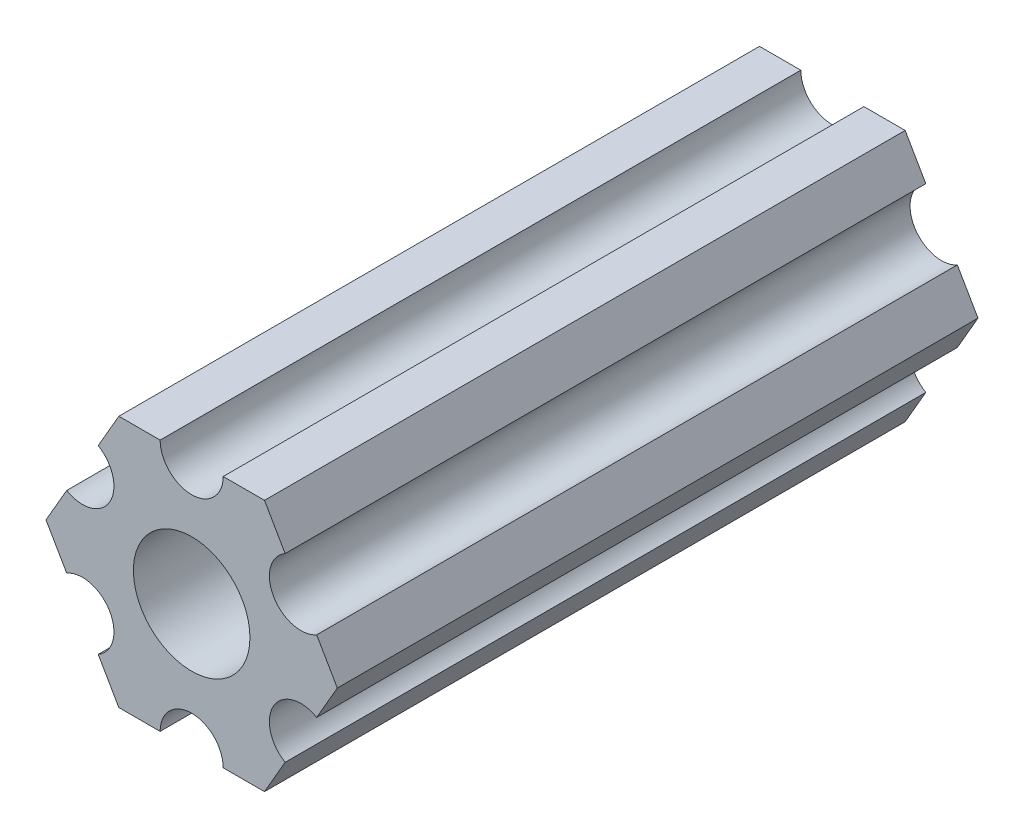
ISO-10303-21;
HEADER;
FILE_DESCRIPTION(('STEP AP214'),'2;1');
FILE_NAME('part.step','',(''),(''),'','','');
FILE_SCHEMA(('AUTOMOTIVE_DESIGN { 1 0 10303 214 1 1 1 1 }'));
ENDSEC;
DATA;
#1=APPLICATION_CONTEXT('core data for automotive mechanical design processes');
#2=APPLICATION_PROTOCOL_DEFINITION('international standard','automotive_design',2000,#1);
#3=PRODUCT_CONTEXT('',#1,'mechanical');
#4=PRODUCT('Part','Part','',(#3));
#5=PRODUCT_RELATED_PRODUCT_CATEGORY('part','',(#4));
#6=PRODUCT_DEFINITION_FORMATION('','',#4);
#7=PRODUCT_DEFINITION_CONTEXT('part definition',#1,'design');
#8=PRODUCT_DEFINITION('design','',#6,#7);
#9=PRODUCT_DEFINITION_SHAPE('','',#8);
#10=(LENGTH_UNIT() NAMED_UNIT(*) SI_UNIT(.MILLI.,.METRE.));
#11=(NAMED_UNIT(*) PLANE_ANGLE_UNIT() SI_UNIT($,.RADIAN.));
#12=(NAMED_UNIT(*) SI_UNIT($,.STERADIAN.) SOLID_ANGLE_UNIT());
#13=UNCERTAINTY_MEASURE_WITH_UNIT(LENGTH_MEASURE(1.E-05),#10,'distance_accuracy_value','');
#14=(GEOMETRIC_REPRESENTATION_CONTEXT(3) GLOBAL_UNCERTAINTY_ASSIGNED_CONTEXT((#13)) GLOBAL_UNIT_ASSIGNED_CONTEXT((#10,
#11,#12)) REPRESENTATION_CONTEXT('',''));
#15=CARTESIAN_POINT('',(0.,0.,0.));
#16=DIRECTION('',(0.,0.,1.));
#17=DIRECTION('',(1.,0.,0.));
#18=AXIS2_PLACEMENT_3D('',#15,#16,#17);
#19=CARTESIAN_POINT('',(5.49926150638083,-3.17499966684068,32.249999));
#20=DIRECTION('',(0.,0.,-1.));
#21=DIRECTION('',(-1.,0.,0.));
#22=AXIS2_PLACEMENT_3D('',#19,#20,#21);
#23=CYLINDRICAL_SURFACE('',#22,1.58750000000001);
#24=CARTESIAN_POINT('',(5.49926150638083,-3.17499966684068,0.));
#25=DIRECTION('',(0.,0.,1.));
#26=DIRECTION('',(1.,0.,0.));
#27=AXIS2_PLACEMENT_3D('',#24,#25,#26);
#28=CIRCLE('',#27,1.58750000000001);
#29=CARTESIAN_POINT('',(6.29301142309098,-1.80018429024546,0.));
#30=VERTEX_POINT('',#29);
#31=CARTESIAN_POINT('',(4.70551158967068,-4.54981504343589,0.));
#32=VERTEX_POINT('',#31);
#33=EDGE_CURVE('E190',#30,#32,#28,.T.);
#34=ORIENTED_EDGE('',*,*,#33,.F.);
#35=DIRECTION('',(0.,0.,-1.));
#36=VECTOR('',#35,1.);
#37=CARTESIAN_POINT('',(6.29301142309098,-1.80018429024546,32.249999));
#38=LINE('',#37,#36);
#39=CARTESIAN_POINT('',(6.29301142309098,-1.80018429024546,32.249999));
#40=VERTEX_POINT('',#39);
#41=EDGE_CURVE('E11',#40,#30,#38,.T.);
#42=ORIENTED_EDGE('',*,*,#41,.F.);
#43=CARTESIAN_POINT('',(5.49926150638083,-3.17499966684068,32.249999));
#44=DIRECTION('',(0.,0.,1.));
#45=DIRECTION('',(1.,0.,0.));
#46=AXIS2_PLACEMENT_3D('',#43,#44,#45);
#47=CIRCLE('',#46,1.58750000000001);
#48=CARTESIAN_POINT('',(4.70551158967068,-4.54981504343589,32.249999));
#49=VERTEX_POINT('',#48);
#50=EDGE_CURVE('E241',#40,#49,#47,.T.);
#51=ORIENTED_EDGE('',*,*,#50,.T.);
#52=DIRECTION('',(0.,0.,-1.));
#53=VECTOR('',#52,1.);
#54=CARTESIAN_POINT('',(4.70551158967068,-4.54981504343589,32.249999));
#55=LINE('',#54,#53);
#56=EDGE_CURVE('E36',#49,#32,#55,.T.);
#57=ORIENTED_EDGE('',*,*,#56,.T.);
#58=EDGE_LOOP('',(#34,#42,#51,#57));
#59=FACE_BOUND('',#58,.T.);
#60=ADVANCED_FACE('F33',(#59),#23,.F.);
#61=CARTESIAN_POINT('',(7.33234841870826,4.44212518856872E-07,32.249999));
#62=DIRECTION('',(0.866025434075723,-0.499999947533953,0.));
#63=DIRECTION('',(0.499999947533953,0.866025434075723,0.));
#64=AXIS2_PLACEMENT_3D('',#61,#62,#63);
#65=PLANE('',#64);
#66=DIRECTION('',(-0.499999947533953,-0.866025434075723,0.));
#67=VECTOR('',#66,1.);
#68=CARTESIAN_POINT('',(7.33234841870826,4.44212518856872E-07,0.));
#69=LINE('',#68,#67);
#70=CARTESIAN_POINT('',(7.33234841870826,4.44212518856872E-07,0.));
#71=VERTEX_POINT('',#70);
#72=EDGE_CURVE('E239',#71,#30,#69,.T.);
#73=ORIENTED_EDGE('',*,*,#72,.F.);
#74=DIRECTION('',(0.,0.,-1.));
#75=VECTOR('',#74,1.);
#76=CARTESIAN_POINT('',(7.33234841870826,4.44212518856872E-07,32.249999));
#77=LINE('',#76,#75);
#78=CARTESIAN_POINT('',(7.33234841870826,4.44212518856872E-07,32.249999));
#79=VERTEX_POINT('',#78);
#80=EDGE_CURVE('E42',#79,#71,#77,.T.);
#81=ORIENTED_EDGE('',*,*,#80,.F.);
#82=DIRECTION('',(-0.499999947533953,-0.866025434075723,0.));
#83=VECTOR('',#82,1.);
#84=CARTESIAN_POINT('',(7.33234841870826,4.44212518856872E-07,32.249999));
#85=LINE('',#84,#83);
#86=EDGE_CURVE('E180',#79,#40,#85,.T.);
#87=ORIENTED_EDGE('',*,*,#86,.T.);
#88=ORIENTED_EDGE('',*,*,#41,.T.);
#89=EDGE_LOOP('',(#73,#81,#87,#88));
#90=FACE_BOUND('',#89,.T.);
#91=ADVANCED_FACE('F273',(#90),#65,.T.);
#92=CARTESIAN_POINT('',(6.29301120497139,1.80018505273895,32.249999));
#93=DIRECTION('',(0.866025373493145,0.500000052466056,0.));
#94=DIRECTION('',(-0.500000052466056,0.866025373493145,0.));
#95=AXIS2_PLACEMENT_3D('',#92,#93,#94);
#96=PLANE('',#95);
#97=DIRECTION('',(0.500000052466056,-0.866025373493145,0.));
#98=VECTOR('',#97,1.);
#99=CARTESIAN_POINT('',(6.29301120497139,1.80018505273895,0.));
#100=LINE('',#99,#98);
#101=CARTESIAN_POINT('',(6.29301120497139,1.80018505273895,0.));
#102=VERTEX_POINT('',#101);
#103=EDGE_CURVE('E167',#102,#71,#100,.T.);
#104=ORIENTED_EDGE('',*,*,#103,.F.);
#105=DIRECTION('',(0.,0.,-1.));
#106=VECTOR('',#105,1.);
#107=CARTESIAN_POINT('',(6.29301120497139,1.80018505273895,32.249999));
#108=LINE('',#107,#106);
#109=CARTESIAN_POINT('',(6.29301120497139,1.80018505273895,32.249999));
#110=VERTEX_POINT('',#109);
#111=EDGE_CURVE('E162',#110,#102,#108,.T.);
#112=ORIENTED_EDGE('',*,*,#111,.F.);
#113=DIRECTION('',(0.500000052466056,-0.866025373493145,0.));
#114=VECTOR('',#113,1.);
#115=CARTESIAN_POINT('',(6.29301120497139,1.80018505273895,32.249999));
#116=LINE('',#115,#114);
#117=EDGE_CURVE('E165',#110,#79,#116,.T.);
#118=ORIENTED_EDGE('',*,*,#117,.T.);
#119=ORIENTED_EDGE('',*,*,#80,.T.);
#120=EDGE_LOOP('',(#104,#112,#118,#119));
#121=FACE_BOUND('',#120,.T.);
#122=ADVANCED_FACE('F164',(#121),#96,.T.);
#123=CARTESIAN_POINT('',(5.49926112168152,3.17500033315931,32.249999));
#124=DIRECTION('',(0.,0.,-1.));
#125=DIRECTION('',(-1.,0.,0.));
#126=AXIS2_PLACEMENT_3D('',#123,#124,#125);
#127=CYLINDRICAL_SURFACE('',#126,1.5875);
#128=CARTESIAN_POINT('',(5.49926112168152,3.17500033315931,0.));
#129=DIRECTION('',(0.,0.,1.));
#130=DIRECTION('',(1.,0.,0.));
#131=AXIS2_PLACEMENT_3D('',#128,#129,#130);
#132=CIRCLE('',#131,1.5875);
#133=CARTESIAN_POINT('',(4.70551103839166,4.54981561357968,0.));
#134=VERTEX_POINT('',#133);
#135=EDGE_CURVE('E236',#134,#102,#132,.T.);
#136=ORIENTED_EDGE('',*,*,#135,.F.);
#137=DIRECTION('',(0.,0.,-1.));
#138=VECTOR('',#137,1.);
#139=CARTESIAN_POINT('',(4.70551103839166,4.54981561357968,32.249999));
#140=LINE('',#139,#138);
#141=CARTESIAN_POINT('',(4.70551103839166,4.54981561357968,32.249999));
#142=VERTEX_POINT('',#141);
#143=EDGE_CURVE('E172',#142,#134,#140,.T.);
#144=ORIENTED_EDGE('',*,*,#143,.F.);
#145=CARTESIAN_POINT('',(5.49926112168152,3.17500033315931,32.249999));
#146=DIRECTION('',(0.,0.,1.));
#147=DIRECTION('',(1.,0.,0.));
#148=AXIS2_PLACEMENT_3D('',#145,#146,#147);
#149=CIRCLE('',#148,1.5875);
#150=EDGE_CURVE('E178',#142,#110,#149,.T.);
#151=ORIENTED_EDGE('',*,*,#150,.T.);
#152=ORIENTED_EDGE('',*,*,#111,.T.);
#153=EDGE_LOOP('',(#136,#144,#151,#152));
#154=FACE_BOUND('',#153,.T.);
#155=ADVANCED_FACE('F182',(#154),#127,.F.);
#156=CARTESIAN_POINT('',(3.66617382465472,6.35000022210622,32.249999));
#157=DIRECTION('',(0.866025373493145,0.500000052466056,0.));
#158=DIRECTION('',(-0.500000052466056,0.866025373493145,0.));
#159=AXIS2_PLACEMENT_3D('',#156,#157,#158);
#160=PLANE('',#159);
#161=DIRECTION('',(0.500000052466056,-0.866025373493145,0.));
#162=VECTOR('',#161,1.);
#163=CARTESIAN_POINT('',(3.66617382465472,6.35000022210622,0.));
#164=LINE('',#163,#162);
#165=CARTESIAN_POINT('',(3.66617382465472,6.35000022210622,0.));
#166=VERTEX_POINT('',#165);
#167=EDGE_CURVE('E233',#166,#134,#164,.T.);
#168=ORIENTED_EDGE('',*,*,#167,.F.);
#169=DIRECTION('',(0.,0.,-1.));
#170=VECTOR('',#169,1.);
#171=CARTESIAN_POINT('',(3.66617382465472,6.35000022210622,32.249999));
#172=LINE('',#171,#170);
#173=CARTESIAN_POINT('',(3.66617382465472,6.35000022210622,32.249999));
#174=VERTEX_POINT('',#173);
#175=EDGE_CURVE('E245',#174,#166,#172,.T.);
#176=ORIENTED_EDGE('',*,*,#175,.F.);
#177=DIRECTION('',(0.500000052466056,-0.866025373493145,0.));
#178=VECTOR('',#177,1.);
#179=CARTESIAN_POINT('',(3.66617382465472,6.35000022210622,32.249999));
#180=LINE('',#179,#178);
#181=EDGE_CURVE('E183',#174,#142,#180,.T.);
#182=ORIENTED_EDGE('',*,*,#181,.T.);
#183=ORIENTED_EDGE('',*,*,#143,.T.);
#184=EDGE_LOOP('',(#168,#176,#182,#183));
#185=FACE_BOUND('',#184,.T.);
#186=ADVANCED_FACE('F286',(#185),#160,.T.);
#187=CARTESIAN_POINT('',(1.58749961530066,6.35000022210623,32.249999));
#188=DIRECTION('',(0.,1.,0.));
#189=DIRECTION('',(-1.,0.,0.));
#190=AXIS2_PLACEMENT_3D('',#187,#188,#189);
#191=PLANE('',#190);
#192=DIRECTION('',(1.,0.,0.));
#193=VECTOR('',#192,1.);
#194=CARTESIAN_POINT('',(1.58749961530066,6.35000022210623,0.));
#195=LINE('',#194,#193);
#196=CARTESIAN_POINT('',(1.58749961530066,6.35000022210623,0.));
#197=VERTEX_POINT('',#196);
#198=EDGE_CURVE('E230',#197,#166,#195,.T.);
#199=ORIENTED_EDGE('',*,*,#198,.F.);
#200=DIRECTION('',(0.,0.,-1.));
#201=VECTOR('',#200,1.);
#202=CARTESIAN_POINT('',(1.58749961530066,6.35000022210623,32.249999));
#203=LINE('',#202,#201);
#204=CARTESIAN_POINT('',(1.58749961530066,6.35000022210623,32.249999));
#205=VERTEX_POINT('',#204);
#206=EDGE_CURVE('E247',#205,#197,#203,.T.);
#207=ORIENTED_EDGE('',*,*,#206,.F.);
#208=DIRECTION('',(1.,0.,0.));
#209=VECTOR('',#208,1.);
#210=CARTESIAN_POINT('',(1.58749961530066,6.35000022210623,32.249999));
#211=LINE('',#210,#209);
#212=EDGE_CURVE('E185',#205,#174,#211,.T.);
#213=ORIENTED_EDGE('',*,*,#212,.T.);
#214=ORIENTED_EDGE('',*,*,#175,.T.);
#215=EDGE_LOOP('',(#199,#207,#213,#214));
#216=FACE_BOUND('',#215,.T.);
#217=ADVANCED_FACE('F289',(#216),#191,.T.);
#218=CARTESIAN_POINT('',(-3.84699344941095E-07,6.35000022210623,32.249999));
#219=DIRECTION('',(0.,0.,-1.));
#220=DIRECTION('',(-1.,0.,0.));
#221=AXIS2_PLACEMENT_3D('',#218,#219,#220);
#222=CYLINDRICAL_SURFACE('',#221,1.5875);
#223=CARTESIAN_POINT('',(-3.84699344941095E-07,6.35000022210623,0.));
#224=DIRECTION('',(0.,0.,1.));
#225=DIRECTION('',(1.,0.,0.));
#226=AXIS2_PLACEMENT_3D('',#223,#224,#225);
#227=CIRCLE('',#226,1.5875);
#228=CARTESIAN_POINT('',(-1.58750038469935,6.35000022210623,0.));
#229=VERTEX_POINT('',#228);
#230=EDGE_CURVE('E227',#229,#197,#227,.T.);
#231=ORIENTED_EDGE('',*,*,#230,.F.);
#232=DIRECTION('',(0.,0.,-1.));
#233=VECTOR('',#232,1.);
#234=CARTESIAN_POINT('',(-1.58750038469935,6.35000022210623,32.249999));
#235=LINE('',#234,#233);
#236=CARTESIAN_POINT('',(-1.58750038469935,6.35000022210623,32.249999));
#237=VERTEX_POINT('',#236);
#238=EDGE_CURVE('E249',#237,#229,#235,.T.);
#239=ORIENTED_EDGE('',*,*,#238,.F.);
#240=CARTESIAN_POINT('',(-3.84699344941095E-07,6.35000022210623,32.249999));
#241=DIRECTION('',(0.,0.,1.));
#242=DIRECTION('',(1.,0.,0.));
#243=AXIS2_PLACEMENT_3D('',#240,#241,#242);
#244=CIRCLE('',#243,1.5875);
#245=EDGE_CURVE('E394',#237,#205,#244,.T.);
#246=ORIENTED_EDGE('',*,*,#245,.T.);
#247=ORIENTED_EDGE('',*,*,#206,.T.);
#248=EDGE_LOOP('',(#231,#239,#246,#247));
#249=FACE_BOUND('',#248,.T.);
#250=ADVANCED_FACE('F293',(#249),#222,.F.);
#251=CARTESIAN_POINT('',(-3.66617452134701,6.35000022210623,32.249999));
#252=DIRECTION('',(0.,1.,0.));
#253=DIRECTION('',(0.,0.,1.));
#254=AXIS2_PLACEMENT_3D('',#251,#252,#253);
#255=PLANE('',#254);
#256=DIRECTION('',(1.,0.,0.));
#257=VECTOR('',#256,1.);
#258=CARTESIAN_POINT('',(-3.66617452134701,6.35000022210623,0.));
#259=LINE('',#258,#257);
#260=CARTESIAN_POINT('',(-3.66617452134701,6.35000022210623,0.));
#261=VERTEX_POINT('',#260);
#262=EDGE_CURVE('E224',#261,#229,#259,.T.);
#263=ORIENTED_EDGE('',*,*,#262,.F.);
#264=DIRECTION('',(0.,0.,-1.));
#265=VECTOR('',#264,1.);
#266=CARTESIAN_POINT('',(-3.66617452134701,6.35000022210623,32.249999));
#267=LINE('',#266,#265);
#268=CARTESIAN_POINT('',(-3.66617452134701,6.35000022210623,32.249999));
#269=VERTEX_POINT('',#268);
#270=EDGE_CURVE('E251',#269,#261,#267,.T.);
#271=ORIENTED_EDGE('',*,*,#270,.F.);
#272=DIRECTION('',(1.,0.,0.));
#273=VECTOR('',#272,1.);
#274=CARTESIAN_POINT('',(-3.66617452134701,6.35000022210623,32.249999));
#275=LINE('',#274,#273);
#276=EDGE_CURVE('E391',#269,#237,#275,.T.);
#277=ORIENTED_EDGE('',*,*,#276,.T.);
#278=ORIENTED_EDGE('',*,*,#238,.T.);
#279=EDGE_LOOP('',(#263,#271,#277,#278));
#280=FACE_BOUND('',#279,.T.);
#281=ADVANCED_FACE('F297',(#280),#255,.T.);
#282=CARTESIAN_POINT('',(-4.70551145677116,4.54981548085265,32.249999));
#283=DIRECTION('',(-0.866025447431971,0.499999924400249,0.));
#284=DIRECTION('',(-0.499999924400249,-0.866025447431971,0.));
#285=AXIS2_PLACEMENT_3D('',#282,#283,#284);
#286=PLANE('',#285);
#287=DIRECTION('',(0.499999924400249,0.866025447431971,0.));
#288=VECTOR('',#287,1.);
#289=CARTESIAN_POINT('',(-4.70551145677116,4.54981548085265,0.));
#290=LINE('',#289,#288);
#291=CARTESIAN_POINT('',(-4.70551145677116,4.54981548085265,0.));
#292=VERTEX_POINT('',#291);
#293=EDGE_CURVE('E221',#292,#261,#290,.T.);
#294=ORIENTED_EDGE('',*,*,#293,.F.);
#295=DIRECTION('',(0.,0.,-1.));
#296=VECTOR('',#295,1.);
#297=CARTESIAN_POINT('',(-4.70551145677116,4.54981548085265,32.249999));
#298=LINE('',#297,#296);
#299=CARTESIAN_POINT('',(-4.70551145677116,4.54981548085265,32.249999));
#300=VERTEX_POINT('',#299);
#301=EDGE_CURVE('E253',#300,#292,#298,.T.);
#302=ORIENTED_EDGE('',*,*,#301,.F.);
#303=DIRECTION('',(0.499999924400249,0.866025447431971,0.));
#304=VECTOR('',#303,1.);
#305=CARTESIAN_POINT('',(-4.70551145677116,4.54981548085265,32.249999));
#306=LINE('',#305,#304);
#307=EDGE_CURVE('E388',#300,#269,#306,.T.);
#308=ORIENTED_EDGE('',*,*,#307,.T.);
#309=ORIENTED_EDGE('',*,*,#270,.T.);
#310=EDGE_LOOP('',(#294,#302,#308,#309));
#311=FACE_BOUND('',#310,.T.);
#312=ADVANCED_FACE('F301',(#311),#286,.T.);
#313=CARTESIAN_POINT('',(-5.49926133675655,3.17500008305439,32.249999));
#314=DIRECTION('',(0.,0.,-1.));
#315=DIRECTION('',(-1.,0.,0.));
#316=AXIS2_PLACEMENT_3D('',#313,#314,#315);
#317=CYLINDRICAL_SURFACE('',#316,1.5875);
#318=CARTESIAN_POINT('',(-5.49926133675655,3.17500008305439,0.));
#319=DIRECTION('',(0.,0.,1.));
#320=DIRECTION('',(1.,0.,0.));
#321=AXIS2_PLACEMENT_3D('',#318,#319,#320);
#322=CIRCLE('',#321,1.5875);
#323=CARTESIAN_POINT('',(-6.29301121674195,1.80018468525613,0.));
#324=VERTEX_POINT('',#323);
#325=EDGE_CURVE('E218',#324,#292,#322,.T.);
#326=ORIENTED_EDGE('',*,*,#325,.F.);
#327=DIRECTION('',(0.,0.,-1.));
#328=VECTOR('',#327,1.);
#329=CARTESIAN_POINT('',(-6.29301121674195,1.80018468525613,32.249999));
#330=LINE('',#329,#328);
#331=CARTESIAN_POINT('',(-6.29301121674195,1.80018468525613,32.249999));
#332=VERTEX_POINT('',#331);
#333=EDGE_CURVE('E255',#332,#324,#330,.T.);
#334=ORIENTED_EDGE('',*,*,#333,.F.);
#335=CARTESIAN_POINT('',(-5.49926133675655,3.17500008305439,32.249999));
#336=DIRECTION('',(0.,0.,1.));
#337=DIRECTION('',(1.,0.,0.));
#338=AXIS2_PLACEMENT_3D('',#335,#336,#337);
#339=CIRCLE('',#338,1.5875);
#340=EDGE_CURVE('E385',#332,#300,#339,.T.);
#341=ORIENTED_EDGE('',*,*,#340,.T.);
#342=ORIENTED_EDGE('',*,*,#301,.T.);
#343=EDGE_LOOP('',(#326,#334,#341,#342));
#344=FACE_BOUND('',#343,.T.);
#345=ADVANCED_FACE('F305',(#344),#317,.F.);
#346=CARTESIAN_POINT('',(-7.33234807945963,6.99338729030344E-08,32.249999));
#347=DIRECTION('',(-0.866025447431971,0.499999924400249,0.));
#348=DIRECTION('',(-0.499999924400249,-0.866025447431971,0.));
#349=AXIS2_PLACEMENT_3D('',#346,#347,#348);
#350=PLANE('',#349);
#351=DIRECTION('',(0.499999924400249,0.866025447431971,0.));
#352=VECTOR('',#351,1.);
#353=CARTESIAN_POINT('',(-7.33234807945963,6.99338729030344E-08,0.));
#354=LINE('',#353,#352);
#355=CARTESIAN_POINT('',(-7.33234807945963,6.99338729030344E-08,0.));
#356=VERTEX_POINT('',#355);
#357=EDGE_CURVE('E215',#356,#324,#354,.T.);
#358=ORIENTED_EDGE('',*,*,#357,.F.);
#359=DIRECTION('',(0.,0.,-1.));
#360=VECTOR('',#359,1.);
#361=CARTESIAN_POINT('',(-7.33234807945963,6.99338729030344E-08,32.249999));
#362=LINE('',#361,#360);
#363=CARTESIAN_POINT('',(-7.33234807945963,6.99338729030344E-08,32.249999));
#364=VERTEX_POINT('',#363);
#365=EDGE_CURVE('E257',#364,#356,#362,.T.);
#366=ORIENTED_EDGE('',*,*,#365,.F.);
#367=DIRECTION('',(0.499999924400249,0.866025447431971,0.));
#368=VECTOR('',#367,1.);
#369=CARTESIAN_POINT('',(-7.33234807945963,6.99338729030344E-08,32.249999));
#370=LINE('',#369,#368);
#371=EDGE_CURVE('E382',#364,#332,#370,.T.);
#372=ORIENTED_EDGE('',*,*,#371,.T.);
#373=ORIENTED_EDGE('',*,*,#333,.T.);
#374=EDGE_LOOP('',(#358,#366,#372,#373));
#375=FACE_BOUND('',#374,.T.);
#376=ADVANCED_FACE('F309',(#375),#350,.T.);
#377=CARTESIAN_POINT('',(-6.29301096189761,-1.80018459411914,32.249999));
#378=DIRECTION('',(-0.866025400205645,-0.500000006198653,0.));
#379=DIRECTION('',(0.500000006198653,-0.866025400205645,0.));
#380=AXIS2_PLACEMENT_3D('',#377,#378,#379);
#381=PLANE('',#380);
#382=DIRECTION('',(-0.500000006198653,0.866025400205645,0.));
#383=VECTOR('',#382,1.);
#384=CARTESIAN_POINT('',(-6.29301096189761,-1.80018459411914,0.));
#385=LINE('',#384,#383);
#386=CARTESIAN_POINT('',(-6.29301096189761,-1.80018459411914,0.));
#387=VERTEX_POINT('',#386);
#388=EDGE_CURVE('E212',#387,#356,#385,.T.);
#389=ORIENTED_EDGE('',*,*,#388,.F.);
#390=DIRECTION('',(0.,0.,-1.));
#391=VECTOR('',#390,1.);
#392=CARTESIAN_POINT('',(-6.29301096189761,-1.80018459411914,32.249999));
#393=LINE('',#392,#391);
#394=CARTESIAN_POINT('',(-6.29301096189761,-1.80018459411914,32.249999));
#395=VERTEX_POINT('',#394);
#396=EDGE_CURVE('E259',#395,#387,#393,.T.);
#397=ORIENTED_EDGE('',*,*,#396,.F.);
#398=DIRECTION('',(-0.500000006198653,0.866025400205645,0.));
#399=VECTOR('',#398,1.);
#400=CARTESIAN_POINT('',(-6.29301096189761,-1.80018459411914,32.249999));
#401=LINE('',#400,#399);
#402=EDGE_CURVE('E379',#395,#364,#401,.T.);
#403=ORIENTED_EDGE('',*,*,#402,.T.);
#404=ORIENTED_EDGE('',*,*,#365,.T.);
#405=EDGE_LOOP('',(#389,#397,#403,#404));
#406=FACE_BOUND('',#405,.T.);
#407=ADVANCED_FACE('F313',(#406),#381,.T.);
#408=CARTESIAN_POINT('',(-5.49926095205725,-3.1749999169456,32.249999));
#409=DIRECTION('',(0.,0.,-1.));
#410=DIRECTION('',(-1.,0.,0.));
#411=AXIS2_PLACEMENT_3D('',#408,#409,#410);
#412=CYLINDRICAL_SURFACE('',#411,1.5875);
#413=CARTESIAN_POINT('',(-5.49926095205725,-3.1749999169456,0.));
#414=DIRECTION('',(0.,0.,1.));
#415=DIRECTION('',(1.,0.,0.));
#416=AXIS2_PLACEMENT_3D('',#413,#414,#415);
#417=CIRCLE('',#416,1.5875);
#418=CARTESIAN_POINT('',(-4.70551094221689,-4.54981523977206,0.));
#419=VERTEX_POINT('',#418);
#420=EDGE_CURVE('E209',#419,#387,#417,.T.);
#421=ORIENTED_EDGE('',*,*,#420,.F.);
#422=DIRECTION('',(0.,0.,-1.));
#423=VECTOR('',#422,1.);
#424=CARTESIAN_POINT('',(-4.70551094221689,-4.54981523977206,32.249999));
#425=LINE('',#424,#423);
#426=CARTESIAN_POINT('',(-4.70551094221689,-4.54981523977206,32.249999));
#427=VERTEX_POINT('',#426);
#428=EDGE_CURVE('E261',#427,#419,#425,.T.);
#429=ORIENTED_EDGE('',*,*,#428,.F.);
#430=CARTESIAN_POINT('',(-5.49926095205725,-3.1749999169456,32.249999));
#431=DIRECTION('',(0.,0.,1.));
#432=DIRECTION('',(1.,0.,0.));
#433=AXIS2_PLACEMENT_3D('',#430,#431,#432);
#434=CIRCLE('',#433,1.5875);
#435=EDGE_CURVE('E376',#427,#395,#434,.T.);
#436=ORIENTED_EDGE('',*,*,#435,.T.);
#437=ORIENTED_EDGE('',*,*,#396,.T.);
#438=EDGE_LOOP('',(#421,#429,#436,#437));
#439=FACE_BOUND('',#438,.T.);
#440=ADVANCED_FACE('F317',(#439),#412,.F.);
#441=CARTESIAN_POINT('',(-3.66617382465481,-6.34999990382519,32.249999));
#442=DIRECTION('',(-0.866025400205645,-0.500000006198653,0.));
#443=DIRECTION('',(0.500000006198653,-0.866025400205645,0.));
#444=AXIS2_PLACEMENT_3D('',#441,#442,#443);
#445=PLANE('',#444);
#446=DIRECTION('',(-0.500000006198653,0.866025400205644,0.));
#447=VECTOR('',#446,1.);
#448=CARTESIAN_POINT('',(-3.66617382465481,-6.34999990382519,0.));
#449=LINE('',#448,#447);
#450=CARTESIAN_POINT('',(-3.66617382465481,-6.34999990382519,0.));
#451=VERTEX_POINT('',#450);
#452=EDGE_CURVE('E206',#451,#419,#449,.T.);
#453=ORIENTED_EDGE('',*,*,#452,.F.);
#454=DIRECTION('',(0.,0.,-1.));
#455=VECTOR('',#454,1.);
#456=CARTESIAN_POINT('',(-3.66617382465481,-6.34999990382519,32.249999));
#457=LINE('',#456,#455);
#458=CARTESIAN_POINT('',(-3.66617382465481,-6.34999990382519,32.249999));
#459=VERTEX_POINT('',#458);
#460=EDGE_CURVE('E263',#459,#451,#457,.T.);
#461=ORIENTED_EDGE('',*,*,#460,.F.);
#462=DIRECTION('',(-0.500000006198653,0.866025400205644,0.));
#463=VECTOR('',#462,1.);
#464=CARTESIAN_POINT('',(-3.66617382465481,-6.34999990382519,32.249999));
#465=LINE('',#464,#463);
#466=EDGE_CURVE('E373',#459,#427,#465,.T.);
#467=ORIENTED_EDGE('',*,*,#466,.T.);
#468=ORIENTED_EDGE('',*,*,#428,.T.);
#469=EDGE_LOOP('',(#453,#461,#467,#468));
#470=FACE_BOUND('',#469,.T.);
#471=ADVANCED_FACE('F321',(#470),#445,.T.);
#472=CARTESIAN_POINT('',(-1.58749961530074,-6.34999990382519,32.249999));
#473=DIRECTION('',(0.,-1.,0.));
#474=DIRECTION('',(1.,0.,0.));
#475=AXIS2_PLACEMENT_3D('',#472,#473,#474);
#476=PLANE('',#475);
#477=DIRECTION('',(-1.,0.,0.));
#478=VECTOR('',#477,1.);
#479=CARTESIAN_POINT('',(-1.58749961530074,-6.34999990382519,0.));
#480=LINE('',#479,#478);
#481=CARTESIAN_POINT('',(-1.58749961530074,-6.34999990382519,0.));
#482=VERTEX_POINT('',#481);
#483=EDGE_CURVE('E203',#482,#451,#480,.T.);
#484=ORIENTED_EDGE('',*,*,#483,.F.);
#485=DIRECTION('',(0.,0.,-1.));
#486=VECTOR('',#485,1.);
#487=CARTESIAN_POINT('',(-1.58749961530074,-6.34999990382519,32.249999));
#488=LINE('',#487,#486);
#489=CARTESIAN_POINT('',(-1.58749961530074,-6.34999990382519,32.249999));
#490=VERTEX_POINT('',#489);
#491=EDGE_CURVE('E265',#490,#482,#488,.T.);
#492=ORIENTED_EDGE('',*,*,#491,.F.);
#493=DIRECTION('',(-1.,0.,0.));
#494=VECTOR('',#493,1.);
#495=CARTESIAN_POINT('',(-1.58749961530074,-6.34999990382519,32.249999));
#496=LINE('',#495,#494);
#497=EDGE_CURVE('E370',#490,#459,#496,.T.);
#498=ORIENTED_EDGE('',*,*,#497,.T.);
#499=ORIENTED_EDGE('',*,*,#460,.T.);
#500=EDGE_LOOP('',(#484,#492,#498,#499));
#501=FACE_BOUND('',#500,.T.);
#502=ADVANCED_FACE('F325',(#501),#476,.T.);
#503=CARTESIAN_POINT('',(3.8469926204343E-07,-6.34999990382519,32.249999));
#504=DIRECTION('',(0.,0.,-1.));
#505=DIRECTION('',(-1.,0.,0.));
#506=AXIS2_PLACEMENT_3D('',#503,#504,#505);
#507=CYLINDRICAL_SURFACE('',#506,1.5875);
#508=CARTESIAN_POINT('',(3.8469926204343E-07,-6.34999990382519,0.));
#509=DIRECTION('',(0.,0.,1.));
#510=DIRECTION('',(1.,0.,0.));
#511=AXIS2_PLACEMENT_3D('',#508,#509,#510);
#512=CIRCLE('',#511,1.5875);
#513=CARTESIAN_POINT('',(1.58750038469926,-6.34999990382518,0.));
#514=VERTEX_POINT('',#513);
#515=EDGE_CURVE('E200',#514,#482,#512,.T.);
#516=ORIENTED_EDGE('',*,*,#515,.F.);
#517=DIRECTION('',(0.,0.,-1.));
#518=VECTOR('',#517,1.);
#519=CARTESIAN_POINT('',(1.58750038469926,-6.34999990382518,32.249999));
#520=LINE('',#519,#518);
#521=CARTESIAN_POINT('',(1.58750038469926,-6.34999990382518,32.249999));
#522=VERTEX_POINT('',#521);
#523=EDGE_CURVE('E267',#522,#514,#520,.T.);
#524=ORIENTED_EDGE('',*,*,#523,.F.);
#525=CARTESIAN_POINT('',(3.8469926204343E-07,-6.34999990382519,32.249999));
#526=DIRECTION('',(0.,0.,1.));
#527=DIRECTION('',(1.,0.,0.));
#528=AXIS2_PLACEMENT_3D('',#525,#526,#527);
#529=CIRCLE('',#528,1.5875);
#530=EDGE_CURVE('E367',#522,#490,#529,.T.);
#531=ORIENTED_EDGE('',*,*,#530,.T.);
#532=ORIENTED_EDGE('',*,*,#491,.T.);
#533=EDGE_LOOP('',(#516,#524,#531,#532));
#534=FACE_BOUND('',#533,.T.);
#535=ADVANCED_FACE('F329',(#534),#507,.F.);
#536=CARTESIAN_POINT('',(3.66617452134693,-6.34999990382519,32.249999));
#537=DIRECTION('',(0.,-1.,0.));
#538=DIRECTION('',(1.,0.,0.));
#539=AXIS2_PLACEMENT_3D('',#536,#537,#538);
#540=PLANE('',#539);
#541=DIRECTION('',(-1.,0.,0.));
#542=VECTOR('',#541,1.);
#543=CARTESIAN_POINT('',(3.66617452134693,-6.34999990382519,0.));
#544=LINE('',#543,#542);
#545=CARTESIAN_POINT('',(3.66617452134693,-6.34999990382519,0.));
#546=VERTEX_POINT('',#545);
#547=EDGE_CURVE('E197',#546,#514,#544,.T.);
#548=ORIENTED_EDGE('',*,*,#547,.F.);
#549=DIRECTION('',(0.,0.,-1.));
#550=VECTOR('',#549,1.);
#551=CARTESIAN_POINT('',(3.66617452134693,-6.34999990382519,32.249999));
#552=LINE('',#551,#550);
#553=CARTESIAN_POINT('',(3.66617452134693,-6.34999990382519,32.249999));
#554=VERTEX_POINT('',#553);
#555=EDGE_CURVE('E268',#554,#546,#552,.T.);
#556=ORIENTED_EDGE('',*,*,#555,.F.);
#557=DIRECTION('',(-1.,0.,0.));
#558=VECTOR('',#557,1.);
#559=CARTESIAN_POINT('',(3.66617452134693,-6.34999990382519,32.249999));
#560=LINE('',#559,#558);
#561=EDGE_CURVE('E364',#554,#522,#560,.T.);
#562=ORIENTED_EDGE('',*,*,#561,.T.);
#563=ORIENTED_EDGE('',*,*,#523,.T.);
#564=EDGE_LOOP('',(#548,#556,#562,#563));
#565=FACE_BOUND('',#564,.T.);
#566=ADVANCED_FACE('F333',(#565),#540,.T.);
#567=CARTESIAN_POINT('',(4.70551158967068,-4.54981504343589,32.249999));
#568=DIRECTION('',(0.866025434075723,-0.499999947533953,0.));
#569=DIRECTION('',(0.499999947533953,0.866025434075723,0.));
#570=AXIS2_PLACEMENT_3D('',#567,#568,#569);
#571=PLANE('',#570);
#572=DIRECTION('',(-0.499999947533953,-0.866025434075723,0.));
#573=VECTOR('',#572,1.);
#574=CARTESIAN_POINT('',(4.70551158967068,-4.54981504343589,0.));
#575=LINE('',#574,#573);
#576=EDGE_CURVE('E193',#32,#546,#575,.T.);
#577=ORIENTED_EDGE('',*,*,#576,.F.);
#578=ORIENTED_EDGE('',*,*,#56,.F.);
#579=DIRECTION('',(-0.499999947533953,-0.866025434075723,0.));
#580=VECTOR('',#579,1.);
#581=CARTESIAN_POINT('',(4.70551158967068,-4.54981504343589,32.249999));
#582=LINE('',#581,#580);
#583=EDGE_CURVE('E362',#49,#554,#582,.T.);
#584=ORIENTED_EDGE('',*,*,#583,.T.);
#585=ORIENTED_EDGE('',*,*,#555,.T.);
#586=EDGE_LOOP('',(#577,#578,#584,#585));
#587=FACE_BOUND('',#586,.T.);
#588=ADVANCED_FACE('F270',(#587),#571,.T.);
#589=CARTESIAN_POINT('',(5.49926150638083,-3.17499966684068,32.249999));
#590=DIRECTION('',(0.,0.,1.));
#591=DIRECTION('',(1.,0.,0.));
#592=AXIS2_PLACEMENT_3D('',#589,#590,#591);
#593=PLANE('',#592);
#594=CARTESIAN_POINT('',(0.,0.,32.249999));
#595=DIRECTION('',(0.,0.,-1.));
#596=DIRECTION('',(1.,0.,0.));
#597=AXIS2_PLACEMENT_3D('',#594,#595,#596);
#598=CIRCLE('',#597,2.9337);
#599=CARTESIAN_POINT('',(2.9337,0.,32.249999));
#600=VERTEX_POINT('',#599);
#601=EDGE_CURVE('E194',#600,#600,#598,.T.);
#602=ORIENTED_EDGE('',*,*,#601,.T.);
#603=EDGE_LOOP('',(#602));
#604=FACE_BOUND('',#603,.T.);
#605=ORIENTED_EDGE('',*,*,#50,.F.);
#606=ORIENTED_EDGE('',*,*,#86,.F.);
#607=ORIENTED_EDGE('',*,*,#117,.F.);
#608=ORIENTED_EDGE('',*,*,#150,.F.);
#609=ORIENTED_EDGE('',*,*,#181,.F.);
#610=ORIENTED_EDGE('',*,*,#212,.F.);
#611=ORIENTED_EDGE('',*,*,#245,.F.);
#612=ORIENTED_EDGE('',*,*,#276,.F.);
#613=ORIENTED_EDGE('',*,*,#307,.F.);
#614=ORIENTED_EDGE('',*,*,#340,.F.);
#615=ORIENTED_EDGE('',*,*,#371,.F.);
#616=ORIENTED_EDGE('',*,*,#402,.F.);
#617=ORIENTED_EDGE('',*,*,#435,.F.);
#618=ORIENTED_EDGE('',*,*,#466,.F.);
#619=ORIENTED_EDGE('',*,*,#497,.F.);
#620=ORIENTED_EDGE('',*,*,#530,.F.);
#621=ORIENTED_EDGE('',*,*,#561,.F.);
#622=ORIENTED_EDGE('',*,*,#583,.F.);
#623=EDGE_LOOP('',(#605,#606,#607,#608,#609,#610,#611,#612,#613,#614,#615,#616,#617,#618,#619,
#620,#621,#622));
#624=FACE_BOUND('',#623,.T.);
#625=ADVANCED_FACE('F176',(#604,#624),#593,.T.);
#626=CARTESIAN_POINT('',(5.49926150638083,-3.17499966684068,0.));
#627=DIRECTION('',(0.,0.,1.));
#628=DIRECTION('',(1.,0.,0.));
#629=AXIS2_PLACEMENT_3D('',#626,#627,#628);
#630=PLANE('',#629);
#631=CARTESIAN_POINT('',(0.,0.,0.));
#632=DIRECTION('',(0.,0.,-1.));
#633=DIRECTION('',(1.,0.,0.));
#634=AXIS2_PLACEMENT_3D('',#631,#632,#633);
#635=CIRCLE('',#634,2.9337);
#636=CARTESIAN_POINT('',(2.9337,0.,0.));
#637=VERTEX_POINT('',#636);
#638=EDGE_CURVE('E357',#637,#637,#635,.T.);
#639=ORIENTED_EDGE('',*,*,#638,.F.);
#640=EDGE_LOOP('',(#639));
#641=FACE_BOUND('',#640,.T.);
#642=ORIENTED_EDGE('',*,*,#33,.T.);
#643=ORIENTED_EDGE('',*,*,#576,.T.);
#644=ORIENTED_EDGE('',*,*,#547,.T.);
#645=ORIENTED_EDGE('',*,*,#515,.T.);
#646=ORIENTED_EDGE('',*,*,#483,.T.);
#647=ORIENTED_EDGE('',*,*,#452,.T.);
#648=ORIENTED_EDGE('',*,*,#420,.T.);
#649=ORIENTED_EDGE('',*,*,#388,.T.);
#650=ORIENTED_EDGE('',*,*,#357,.T.);
#651=ORIENTED_EDGE('',*,*,#325,.T.);
#652=ORIENTED_EDGE('',*,*,#293,.T.);
#653=ORIENTED_EDGE('',*,*,#262,.T.);
#654=ORIENTED_EDGE('',*,*,#230,.T.);
#655=ORIENTED_EDGE('',*,*,#198,.T.);
#656=ORIENTED_EDGE('',*,*,#167,.T.);
#657=ORIENTED_EDGE('',*,*,#135,.T.);
#658=ORIENTED_EDGE('',*,*,#103,.T.);
#659=ORIENTED_EDGE('',*,*,#72,.T.);
#660=EDGE_LOOP('',(#642,#643,#644,#645,#646,#647,#648,#649,#650,#651,#652,#653,#654,#655,#656,
#657,#658,#659));
#661=FACE_BOUND('',#660,.T.);
#662=ADVANCED_FACE('F272',(#641,#661),#630,.F.);
#663=CARTESIAN_POINT('',(0.,0.,32.249999));
#664=DIRECTION('',(0.,0.,-1.));
#665=DIRECTION('',(-1.,0.,0.));
#666=AXIS2_PLACEMENT_3D('',#663,#664,#665);
#667=CYLINDRICAL_SURFACE('',#666,2.9337);
#668=ORIENTED_EDGE('',*,*,#601,.F.);
#669=EDGE_LOOP('',(#668));
#670=FACE_BOUND('',#669,.T.);
#671=ORIENTED_EDGE('',*,*,#638,.T.);
#672=EDGE_LOOP('',(#671));
#673=FACE_BOUND('',#672,.T.);
#674=ADVANCED_FACE('F345',(#670,#673),#667,.F.);
#675=CLOSED_SHELL('',(#60,#91,#122,#155,#186,#217,#250,#281,#312,#345,#376,#407,#440,#471,#502,
#535,#566,#588,#625,#662,#674));
#676=MANIFOLD_SOLID_BREP('B2',#675);
#677=ADVANCED_BREP_SHAPE_REPRESENTATION('',(#18,#676),#14);
#678=SHAPE_DEFINITION_REPRESENTATION(#9,#677);
ENDSEC;
END-ISO-10303-21;
